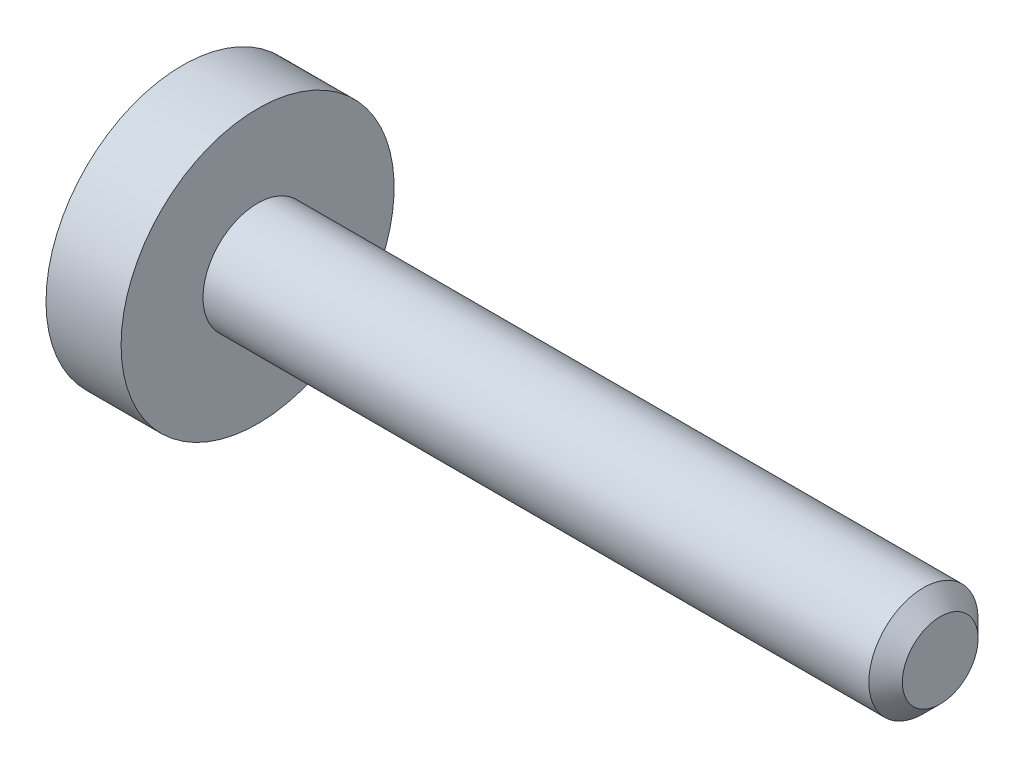
ISO-10303-21;
HEADER;
FILE_DESCRIPTION(('STEP AP214'),'2;1');
FILE_NAME('part.step','',(''),(''),'','','');
FILE_SCHEMA(('AUTOMOTIVE_DESIGN { 1 0 10303 214 1 1 1 1 }'));
ENDSEC;
DATA;
#1=APPLICATION_CONTEXT('core data for automotive mechanical design processes');
#2=APPLICATION_PROTOCOL_DEFINITION('international standard','automotive_design',2000,#1);
#3=PRODUCT_CONTEXT('',#1,'mechanical');
#4=PRODUCT('Part','Part','',(#3));
#5=PRODUCT_RELATED_PRODUCT_CATEGORY('part','',(#4));
#6=PRODUCT_DEFINITION_FORMATION('','',#4);
#7=PRODUCT_DEFINITION_CONTEXT('part definition',#1,'design');
#8=PRODUCT_DEFINITION('design','',#6,#7);
#9=PRODUCT_DEFINITION_SHAPE('','',#8);
#10=(LENGTH_UNIT() NAMED_UNIT(*) SI_UNIT(.MILLI.,.METRE.));
#11=(NAMED_UNIT(*) PLANE_ANGLE_UNIT() SI_UNIT($,.RADIAN.));
#12=(NAMED_UNIT(*) SI_UNIT($,.STERADIAN.) SOLID_ANGLE_UNIT());
#13=UNCERTAINTY_MEASURE_WITH_UNIT(LENGTH_MEASURE(1.E-05),#10,'distance_accuracy_value','');
#14=(GEOMETRIC_REPRESENTATION_CONTEXT(3) GLOBAL_UNCERTAINTY_ASSIGNED_CONTEXT((#13)) GLOBAL_UNIT_ASSIGNED_CONTEXT((#10,
#11,#12)) REPRESENTATION_CONTEXT('',''));
#15=CARTESIAN_POINT('',(0.,0.,0.));
#16=DIRECTION('',(0.,0.,1.));
#17=DIRECTION('',(1.,0.,0.));
#18=AXIS2_PLACEMENT_3D('',#15,#16,#17);
#19=CARTESIAN_POINT('',(-1.1,0.,0.));
#20=DIRECTION('',(1.,0.,0.));
#21=DIRECTION('',(0.,0.,-1.));
#22=AXIS2_PLACEMENT_3D('',#19,#20,#21);
#23=PLANE('',#22);
#24=CARTESIAN_POINT('',(-1.1,0.,0.));
#25=DIRECTION('',(-1.,0.,0.));
#26=DIRECTION('',(0.,0.,1.));
#27=AXIS2_PLACEMENT_3D('',#24,#25,#26);
#28=CIRCLE('',#27,2.);
#29=CARTESIAN_POINT('',(-1.1,0.,2.));
#30=VERTEX_POINT('',#29);
#31=EDGE_CURVE('E11',#30,#30,#28,.T.);
#32=ORIENTED_EDGE('',*,*,#31,.T.);
#33=EDGE_LOOP('',(#32));
#34=FACE_BOUND('',#33,.T.);
#35=DIRECTION('',(0.,-1.,0.));
#36=VECTOR('',#35,1.);
#37=CARTESIAN_POINT('',(-1.1,0.37527767497326,0.65));
#38=LINE('',#37,#36);
#39=CARTESIAN_POINT('',(-1.1,0.37527767497326,0.65));
#40=VERTEX_POINT('',#39);
#41=CARTESIAN_POINT('',(-1.1,-0.37527767497326,0.65));
#42=VERTEX_POINT('',#41);
#43=EDGE_CURVE('E53',#40,#42,#38,.T.);
#44=ORIENTED_EDGE('',*,*,#43,.T.);
#45=DIRECTION('',(0.,-0.499999999999993,-0.866025403784442));
#46=VECTOR('',#45,1.);
#47=CARTESIAN_POINT('',(-1.1,-0.37527767497326,0.65));
#48=LINE('',#47,#46);
#49=CARTESIAN_POINT('',(-1.1,-0.75055534994651,0.));
#50=VERTEX_POINT('',#49);
#51=EDGE_CURVE('E124',#42,#50,#48,.T.);
#52=ORIENTED_EDGE('',*,*,#51,.T.);
#53=DIRECTION('',(0.,0.499999999999993,-0.866025403784442));
#54=VECTOR('',#53,1.);
#55=CARTESIAN_POINT('',(-1.1,-0.75055534994651,0.));
#56=LINE('',#55,#54);
#57=CARTESIAN_POINT('',(-1.1,-0.37527767497326,-0.65));
#58=VERTEX_POINT('',#57);
#59=EDGE_CURVE('E127',#50,#58,#56,.T.);
#60=ORIENTED_EDGE('',*,*,#59,.T.);
#61=DIRECTION('',(0.,1.,0.));
#62=VECTOR('',#61,1.);
#63=CARTESIAN_POINT('',(-1.1,-0.37527767497326,-0.65));
#64=LINE('',#63,#62);
#65=CARTESIAN_POINT('',(-1.1,0.37527767497326,-0.65));
#66=VERTEX_POINT('',#65);
#67=EDGE_CURVE('E130',#58,#66,#64,.T.);
#68=ORIENTED_EDGE('',*,*,#67,.T.);
#69=DIRECTION('',(0.,0.499999999999993,0.866025403784442));
#70=VECTOR('',#69,1.);
#71=CARTESIAN_POINT('',(-1.1,0.37527767497326,-0.65));
#72=LINE('',#71,#70);
#73=CARTESIAN_POINT('',(-1.1,0.75055534994651,0.));
#74=VERTEX_POINT('',#73);
#75=EDGE_CURVE('E114',#66,#74,#72,.T.);
#76=ORIENTED_EDGE('',*,*,#75,.T.);
#77=DIRECTION('',(0.,-0.499999999999993,0.866025403784442));
#78=VECTOR('',#77,1.);
#79=CARTESIAN_POINT('',(-1.1,0.75055534994651,0.));
#80=LINE('',#79,#78);
#81=EDGE_CURVE('E133',#74,#40,#80,.T.);
#82=ORIENTED_EDGE('',*,*,#81,.T.);
#83=EDGE_LOOP('',(#44,#52,#60,#68,#76,#82));
#84=FACE_BOUND('',#83,.T.);
#85=ADVANCED_FACE('F39',(#34,#84),#23,.F.);
#86=CARTESIAN_POINT('',(10.,0.,0.));
#87=DIRECTION('',(-1.,0.,0.));
#88=DIRECTION('',(0.,0.,1.));
#89=AXIS2_PLACEMENT_3D('',#86,#87,#88);
#90=CYLINDRICAL_SURFACE('',#89,2.);
#91=ORIENTED_EDGE('',*,*,#31,.F.);
#92=EDGE_LOOP('',(#91));
#93=FACE_BOUND('',#92,.T.);
#94=CARTESIAN_POINT('',(0.,0.,0.));
#95=DIRECTION('',(-1.,0.,0.));
#96=DIRECTION('',(0.,0.,1.));
#97=AXIS2_PLACEMENT_3D('',#94,#95,#96);
#98=CIRCLE('',#97,2.);
#99=CARTESIAN_POINT('',(0.,0.,2.));
#100=VERTEX_POINT('',#99);
#101=EDGE_CURVE('E46',#100,#100,#98,.T.);
#102=ORIENTED_EDGE('',*,*,#101,.T.);
#103=EDGE_LOOP('',(#102));
#104=FACE_BOUND('',#103,.T.);
#105=ADVANCED_FACE('F155',(#93,#104),#90,.T.);
#106=CARTESIAN_POINT('',(0.,2.,0.));
#107=DIRECTION('',(-1.,0.,0.));
#108=DIRECTION('',(0.,0.,1.));
#109=AXIS2_PLACEMENT_3D('',#106,#107,#108);
#110=PLANE('',#109);
#111=ORIENTED_EDGE('',*,*,#101,.F.);
#112=EDGE_LOOP('',(#111));
#113=FACE_BOUND('',#112,.T.);
#114=CARTESIAN_POINT('',(0.,0.,0.));
#115=DIRECTION('',(-1.,0.,0.));
#116=DIRECTION('',(0.,0.,1.));
#117=AXIS2_PLACEMENT_3D('',#114,#115,#116);
#118=CIRCLE('',#117,0.8);
#119=CARTESIAN_POINT('',(0.,0.,0.8));
#120=VERTEX_POINT('',#119);
#121=EDGE_CURVE('E150',#120,#120,#118,.T.);
#122=ORIENTED_EDGE('',*,*,#121,.T.);
#123=EDGE_LOOP('',(#122));
#124=FACE_BOUND('',#123,.T.);
#125=ADVANCED_FACE('F157',(#113,#124),#110,.F.);
#126=CARTESIAN_POINT('',(10.,0.,0.));
#127=DIRECTION('',(-1.,0.,0.));
#128=DIRECTION('',(0.,0.,1.));
#129=AXIS2_PLACEMENT_3D('',#126,#127,#128);
#130=CYLINDRICAL_SURFACE('',#129,0.800000000000001);
#131=ORIENTED_EDGE('',*,*,#121,.F.);
#132=EDGE_LOOP('',(#131));
#133=FACE_BOUND('',#132,.T.);
#134=CARTESIAN_POINT('',(9.7545,0.,0.));
#135=DIRECTION('',(-1.,0.,0.));
#136=DIRECTION('',(0.,0.,1.));
#137=AXIS2_PLACEMENT_3D('',#134,#135,#136);
#138=CIRCLE('',#137,0.800000000000001);
#139=CARTESIAN_POINT('',(9.7545,0.,0.800000000000001));
#140=VERTEX_POINT('',#139);
#141=EDGE_CURVE('E147',#140,#140,#138,.T.);
#142=ORIENTED_EDGE('',*,*,#141,.T.);
#143=EDGE_LOOP('',(#142));
#144=FACE_BOUND('',#143,.T.);
#145=ADVANCED_FACE('F160',(#133,#144),#130,.T.);
#146=CARTESIAN_POINT('',(10.,0.,0.));
#147=DIRECTION('',(-1.,0.,0.));
#148=DIRECTION('',(0.,0.,1.));
#149=AXIS2_PLACEMENT_3D('',#146,#147,#148);
#150=CONICAL_SURFACE('',#149,0.554500000000002,0.785398163397446);
#151=ORIENTED_EDGE('',*,*,#141,.F.);
#152=EDGE_LOOP('',(#151));
#153=FACE_BOUND('',#152,.T.);
#154=CARTESIAN_POINT('',(10.,0.,0.));
#155=DIRECTION('',(-1.,0.,0.));
#156=DIRECTION('',(0.,0.,1.));
#157=AXIS2_PLACEMENT_3D('',#154,#155,#156);
#158=CIRCLE('',#157,0.554500000000002);
#159=CARTESIAN_POINT('',(10.,0.,0.554500000000002));
#160=VERTEX_POINT('',#159);
#161=EDGE_CURVE('E144',#160,#160,#158,.T.);
#162=ORIENTED_EDGE('',*,*,#161,.T.);
#163=EDGE_LOOP('',(#162));
#164=FACE_BOUND('',#163,.T.);
#165=ADVANCED_FACE('F166',(#153,#164),#150,.T.);
#166=CARTESIAN_POINT('',(10.,0.554500000000002,0.));
#167=DIRECTION('',(-1.,0.,0.));
#168=DIRECTION('',(0.,0.,1.));
#169=AXIS2_PLACEMENT_3D('',#166,#167,#168);
#170=PLANE('',#169);
#171=ORIENTED_EDGE('',*,*,#161,.F.);
#172=EDGE_LOOP('',(#171));
#173=FACE_BOUND('',#172,.T.);
#174=ADVANCED_FACE('F172',(#173),#170,.F.);
#175=CARTESIAN_POINT('',(0.0999999999999998,0.37527767497326,0.65));
#176=DIRECTION('',(0.,0.,-1.));
#177=DIRECTION('',(-1.,0.,0.));
#178=AXIS2_PLACEMENT_3D('',#175,#176,#177);
#179=PLANE('',#178);
#180=ORIENTED_EDGE('',*,*,#43,.F.);
#181=DIRECTION('',(-1.,0.,0.));
#182=VECTOR('',#181,1.);
#183=CARTESIAN_POINT('',(0.0999999999999998,0.37527767497326,0.65));
#184=LINE('',#183,#182);
#185=CARTESIAN_POINT('',(0.0999999999999998,0.37527767497326,0.65));
#186=VERTEX_POINT('',#185);
#187=EDGE_CURVE('E119',#186,#40,#184,.T.);
#188=ORIENTED_EDGE('',*,*,#187,.F.);
#189=DIRECTION('',(0.,-1.,0.));
#190=VECTOR('',#189,1.);
#191=CARTESIAN_POINT('',(0.0999999999999998,0.37527767497326,0.65));
#192=LINE('',#191,#190);
#193=CARTESIAN_POINT('',(0.0999999999999998,-0.37527767497326,0.65));
#194=VERTEX_POINT('',#193);
#195=EDGE_CURVE('E136',#186,#194,#192,.T.);
#196=ORIENTED_EDGE('',*,*,#195,.T.);
#197=DIRECTION('',(-1.,0.,0.));
#198=VECTOR('',#197,1.);
#199=CARTESIAN_POINT('',(0.0999999999999998,-0.37527767497326,0.65));
#200=LINE('',#199,#198);
#201=EDGE_CURVE('E142',#194,#42,#200,.T.);
#202=ORIENTED_EDGE('',*,*,#201,.T.);
#203=EDGE_LOOP('',(#180,#188,#196,#202));
#204=FACE_BOUND('',#203,.T.);
#205=ADVANCED_FACE('F177',(#204),#179,.T.);
#206=CARTESIAN_POINT('',(0.0999999999999998,-0.37527767497326,0.65));
#207=DIRECTION('',(0.,0.866025403784443,-0.499999999999993));
#208=DIRECTION('',(0.,0.499999999999993,0.866025403784442));
#209=AXIS2_PLACEMENT_3D('',#206,#207,#208);
#210=PLANE('',#209);
#211=ORIENTED_EDGE('',*,*,#51,.F.);
#212=ORIENTED_EDGE('',*,*,#201,.F.);
#213=DIRECTION('',(0.,-0.499999999999993,-0.866025403784442));
#214=VECTOR('',#213,1.);
#215=CARTESIAN_POINT('',(0.0999999999999998,-0.37527767497326,0.65));
#216=LINE('',#215,#214);
#217=CARTESIAN_POINT('',(0.0999999999999998,-0.75055534994651,0.));
#218=VERTEX_POINT('',#217);
#219=EDGE_CURVE('E92',#194,#218,#216,.T.);
#220=ORIENTED_EDGE('',*,*,#219,.T.);
#221=DIRECTION('',(-1.,0.,0.));
#222=VECTOR('',#221,1.);
#223=CARTESIAN_POINT('',(0.0999999999999998,-0.75055534994651,0.));
#224=LINE('',#223,#222);
#225=EDGE_CURVE('E140',#218,#50,#224,.T.);
#226=ORIENTED_EDGE('',*,*,#225,.T.);
#227=EDGE_LOOP('',(#211,#212,#220,#226));
#228=FACE_BOUND('',#227,.T.);
#229=ADVANCED_FACE('F182',(#228),#210,.T.);
#230=CARTESIAN_POINT('',(0.0999999999999998,-0.75055534994651,0.));
#231=DIRECTION('',(0.,0.866025403784443,0.499999999999993));
#232=DIRECTION('',(0.,-0.499999999999993,0.866025403784442));
#233=AXIS2_PLACEMENT_3D('',#230,#231,#232);
#234=PLANE('',#233);
#235=ORIENTED_EDGE('',*,*,#59,.F.);
#236=ORIENTED_EDGE('',*,*,#225,.F.);
#237=DIRECTION('',(0.,0.499999999999993,-0.866025403784442));
#238=VECTOR('',#237,1.);
#239=CARTESIAN_POINT('',(0.0999999999999998,-0.75055534994651,0.));
#240=LINE('',#239,#238);
#241=CARTESIAN_POINT('',(0.0999999999999998,-0.37527767497326,-0.65));
#242=VERTEX_POINT('',#241);
#243=EDGE_CURVE('E110',#218,#242,#240,.T.);
#244=ORIENTED_EDGE('',*,*,#243,.T.);
#245=DIRECTION('',(-1.,0.,0.));
#246=VECTOR('',#245,1.);
#247=CARTESIAN_POINT('',(0.0999999999999998,-0.37527767497326,-0.65));
#248=LINE('',#247,#246);
#249=EDGE_CURVE('E107',#242,#58,#248,.T.);
#250=ORIENTED_EDGE('',*,*,#249,.T.);
#251=EDGE_LOOP('',(#235,#236,#244,#250));
#252=FACE_BOUND('',#251,.T.);
#253=ADVANCED_FACE('F199',(#252),#234,.T.);
#254=CARTESIAN_POINT('',(0.0999999999999998,-0.37527767497326,-0.65));
#255=DIRECTION('',(0.,0.,1.));
#256=DIRECTION('',(1.,0.,0.));
#257=AXIS2_PLACEMENT_3D('',#254,#255,#256);
#258=PLANE('',#257);
#259=ORIENTED_EDGE('',*,*,#67,.F.);
#260=ORIENTED_EDGE('',*,*,#249,.F.);
#261=DIRECTION('',(0.,1.,0.));
#262=VECTOR('',#261,1.);
#263=CARTESIAN_POINT('',(0.0999999999999998,-0.37527767497326,-0.65));
#264=LINE('',#263,#262);
#265=CARTESIAN_POINT('',(0.0999999999999998,0.37527767497326,-0.65));
#266=VERTEX_POINT('',#265);
#267=EDGE_CURVE('E102',#242,#266,#264,.T.);
#268=ORIENTED_EDGE('',*,*,#267,.T.);
#269=DIRECTION('',(-1.,0.,0.));
#270=VECTOR('',#269,1.);
#271=CARTESIAN_POINT('',(0.0999999999999998,0.37527767497326,-0.65));
#272=LINE('',#271,#270);
#273=EDGE_CURVE('E106',#266,#66,#272,.T.);
#274=ORIENTED_EDGE('',*,*,#273,.T.);
#275=EDGE_LOOP('',(#259,#260,#268,#274));
#276=FACE_BOUND('',#275,.T.);
#277=ADVANCED_FACE('F105',(#276),#258,.T.);
#278=CARTESIAN_POINT('',(0.0999999999999998,0.37527767497326,-0.65));
#279=DIRECTION('',(0.,-0.866025403784443,0.499999999999993));
#280=DIRECTION('',(0.,-0.499999999999993,-0.866025403784442));
#281=AXIS2_PLACEMENT_3D('',#278,#279,#280);
#282=PLANE('',#281);
#283=ORIENTED_EDGE('',*,*,#75,.F.);
#284=ORIENTED_EDGE('',*,*,#273,.F.);
#285=DIRECTION('',(0.,0.499999999999993,0.866025403784442));
#286=VECTOR('',#285,1.);
#287=CARTESIAN_POINT('',(0.0999999999999998,0.37527767497326,-0.65));
#288=LINE('',#287,#286);
#289=CARTESIAN_POINT('',(0.0999999999999998,0.75055534994651,0.));
#290=VERTEX_POINT('',#289);
#291=EDGE_CURVE('E109',#266,#290,#288,.T.);
#292=ORIENTED_EDGE('',*,*,#291,.T.);
#293=DIRECTION('',(-1.,0.,0.));
#294=VECTOR('',#293,1.);
#295=CARTESIAN_POINT('',(0.0999999999999998,0.75055534994651,0.));
#296=LINE('',#295,#294);
#297=EDGE_CURVE('E83',#290,#74,#296,.T.);
#298=ORIENTED_EDGE('',*,*,#297,.T.);
#299=EDGE_LOOP('',(#283,#284,#292,#298));
#300=FACE_BOUND('',#299,.T.);
#301=ADVANCED_FACE('F112',(#300),#282,.T.);
#302=CARTESIAN_POINT('',(0.0999999999999998,0.75055534994651,0.));
#303=DIRECTION('',(0.,-0.866025403784443,-0.499999999999993));
#304=DIRECTION('',(0.,0.499999999999993,-0.866025403784442));
#305=AXIS2_PLACEMENT_3D('',#302,#303,#304);
#306=PLANE('',#305);
#307=ORIENTED_EDGE('',*,*,#81,.F.);
#308=ORIENTED_EDGE('',*,*,#297,.F.);
#309=DIRECTION('',(0.,-0.499999999999993,0.866025403784442));
#310=VECTOR('',#309,1.);
#311=CARTESIAN_POINT('',(0.0999999999999998,0.75055534994651,0.));
#312=LINE('',#311,#310);
#313=EDGE_CURVE('E61',#290,#186,#312,.T.);
#314=ORIENTED_EDGE('',*,*,#313,.T.);
#315=ORIENTED_EDGE('',*,*,#187,.T.);
#316=EDGE_LOOP('',(#307,#308,#314,#315));
#317=FACE_BOUND('',#316,.T.);
#318=ADVANCED_FACE('F192',(#317),#306,.T.);
#319=CARTESIAN_POINT('',(0.0999999999999998,0.,0.));
#320=DIRECTION('',(1.,0.,0.));
#321=DIRECTION('',(0.,0.,-1.));
#322=AXIS2_PLACEMENT_3D('',#319,#320,#321);
#323=PLANE('',#322);
#324=ORIENTED_EDGE('',*,*,#195,.F.);
#325=ORIENTED_EDGE('',*,*,#313,.F.);
#326=ORIENTED_EDGE('',*,*,#291,.F.);
#327=ORIENTED_EDGE('',*,*,#267,.F.);
#328=ORIENTED_EDGE('',*,*,#243,.F.);
#329=ORIENTED_EDGE('',*,*,#219,.F.);
#330=EDGE_LOOP('',(#324,#325,#326,#327,#328,#329));
#331=FACE_BOUND('',#330,.T.);
#332=ADVANCED_FACE('F117',(#331),#323,.F.);
#333=CLOSED_SHELL('',(#85,#105,#125,#145,#165,#174,#205,#229,#253,#277,#301,#318,#332));
#334=MANIFOLD_SOLID_BREP('B2',#333);
#335=ADVANCED_BREP_SHAPE_REPRESENTATION('',(#18,#334),#14);
#336=SHAPE_DEFINITION_REPRESENTATION(#9,#335);
ENDSEC;
END-ISO-10303-21;
